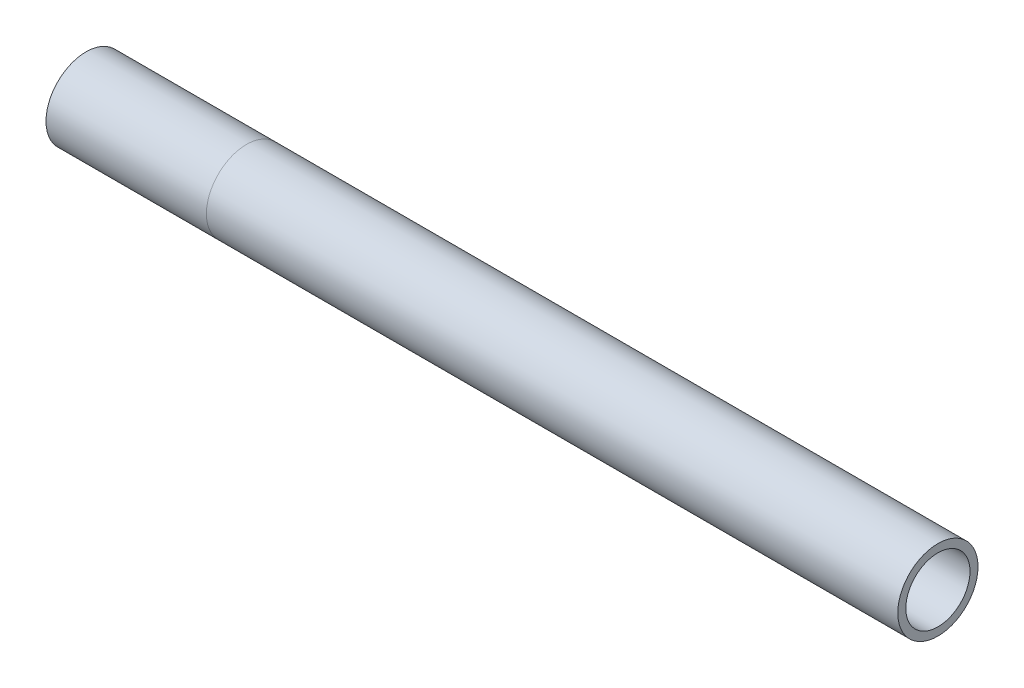
ISO-10303-21;
HEADER;
FILE_DESCRIPTION(('STEP AP214'),'2;1');
FILE_NAME('part.step','',(''),(''),'','','');
FILE_SCHEMA(('AUTOMOTIVE_DESIGN { 1 0 10303 214 1 1 1 1 }'));
ENDSEC;
DATA;
#1=APPLICATION_CONTEXT('core data for automotive mechanical design processes');
#2=APPLICATION_PROTOCOL_DEFINITION('international standard','automotive_design',2000,#1);
#3=PRODUCT_CONTEXT('',#1,'mechanical');
#4=PRODUCT('Part','Part','',(#3));
#5=PRODUCT_RELATED_PRODUCT_CATEGORY('part','',(#4));
#6=PRODUCT_DEFINITION_FORMATION('','',#4);
#7=PRODUCT_DEFINITION_CONTEXT('part definition',#1,'design');
#8=PRODUCT_DEFINITION('design','',#6,#7);
#9=PRODUCT_DEFINITION_SHAPE('','',#8);
#10=(LENGTH_UNIT() NAMED_UNIT(*) SI_UNIT(.MILLI.,.METRE.));
#11=(NAMED_UNIT(*) PLANE_ANGLE_UNIT() SI_UNIT($,.RADIAN.));
#12=(NAMED_UNIT(*) SI_UNIT($,.STERADIAN.) SOLID_ANGLE_UNIT());
#13=UNCERTAINTY_MEASURE_WITH_UNIT(LENGTH_MEASURE(1.E-05),#10,'distance_accuracy_value','');
#14=(GEOMETRIC_REPRESENTATION_CONTEXT(3) GLOBAL_UNCERTAINTY_ASSIGNED_CONTEXT((#13)) GLOBAL_UNIT_ASSIGNED_CONTEXT((#10,
#11,#12)) REPRESENTATION_CONTEXT('',''));
#15=CARTESIAN_POINT('',(0.,0.,0.));
#16=DIRECTION('',(0.,0.,1.));
#17=DIRECTION('',(1.,0.,0.));
#18=AXIS2_PLACEMENT_3D('',#15,#16,#17);
#19=CARTESIAN_POINT('',(-56.518138061836,25.8934908541217,0.));
#20=DIRECTION('',(-1.,0.,0.));
#21=DIRECTION('',(0.,0.,1.));
#22=AXIS2_PLACEMENT_3D('',#19,#20,#21);
#23=CYLINDRICAL_SURFACE('',#22,10.16);
#24=CARTESIAN_POINT('',(-107.318138061836,25.8934908541217,0.));
#25=DIRECTION('',(1.,0.,0.));
#26=DIRECTION('',(0.,0.,-1.));
#27=AXIS2_PLACEMENT_3D('',#24,#25,#26);
#28=CIRCLE('',#27,10.16);
#29=CARTESIAN_POINT('',(-107.318138061836,25.8934908541217,10.16));
#30=VERTEX_POINT('',#29);
#31=EDGE_CURVE('E58',#30,#30,#28,.T.);
#32=CARTESIAN_POINT('',(-56.518138061836,25.8934908541217,0.));
#33=DIRECTION('',(1.,0.,0.));
#34=DIRECTION('',(0.,0.,-1.));
#35=AXIS2_PLACEMENT_3D('',#32,#33,#34);
#36=CIRCLE('',#35,10.16);
#37=CARTESIAN_POINT('',(-56.518138061836,25.8934908541217,10.16));
#38=VERTEX_POINT('',#37);
#39=EDGE_CURVE('E54',#38,#38,#36,.T.);
#40=CARTESIAN_POINT('',(-107.318138061836,25.8934908541217,10.16));
#41=CARTESIAN_POINT('',(-106.788971395169,25.8934908541217,10.16));
#42=CARTESIAN_POINT('',(-106.259804728503,25.8934908541217,10.16));
#43=CARTESIAN_POINT('',(-105.201471395169,25.8934908541217,10.16));
#44=CARTESIAN_POINT('',(-104.672304728503,25.8934908541217,10.16));
#45=CARTESIAN_POINT('',(-103.613971395169,25.8934908541217,10.16));
#46=CARTESIAN_POINT('',(-103.084804728503,25.8934908541217,10.16));
#47=CARTESIAN_POINT('',(-102.026471395169,25.8934908541217,10.16));
#48=CARTESIAN_POINT('',(-101.497304728503,25.8934908541217,10.16));
#49=CARTESIAN_POINT('',(-100.438971395169,25.8934908541217,10.16));
#50=CARTESIAN_POINT('',(-99.9098047285027,25.8934908541217,10.16));
#51=CARTESIAN_POINT('',(-98.8514713951694,25.8934908541217,10.16));
#52=CARTESIAN_POINT('',(-98.3223047285027,25.8934908541217,10.16));
#53=CARTESIAN_POINT('',(-97.2639713951694,25.8934908541217,10.16));
#54=CARTESIAN_POINT('',(-96.7348047285027,25.8934908541217,10.16));
#55=CARTESIAN_POINT('',(-95.6764713951694,25.8934908541217,10.16));
#56=CARTESIAN_POINT('',(-95.1473047285027,25.8934908541217,10.16));
#57=CARTESIAN_POINT('',(-94.0889713951694,25.8934908541217,10.16));
#58=CARTESIAN_POINT('',(-93.5598047285027,25.8934908541217,10.16));
#59=CARTESIAN_POINT('',(-92.5014713951694,25.8934908541217,10.16));
#60=CARTESIAN_POINT('',(-91.9723047285027,25.8934908541217,10.16));
#61=CARTESIAN_POINT('',(-90.9139713951694,25.8934908541217,10.16));
#62=CARTESIAN_POINT('',(-90.3848047285027,25.8934908541217,10.16));
#63=CARTESIAN_POINT('',(-89.3264713951694,25.8934908541217,10.16));
#64=CARTESIAN_POINT('',(-88.7973047285027,25.8934908541217,10.16));
#65=CARTESIAN_POINT('',(-87.7389713951694,25.8934908541217,10.16));
#66=CARTESIAN_POINT('',(-87.2098047285027,25.8934908541217,10.16));
#67=CARTESIAN_POINT('',(-86.1514713951694,25.8934908541217,10.16));
#68=CARTESIAN_POINT('',(-85.6223047285027,25.8934908541217,10.16));
#69=CARTESIAN_POINT('',(-84.5639713951694,25.8934908541217,10.16));
#70=CARTESIAN_POINT('',(-84.0348047285027,25.8934908541217,10.16));
#71=CARTESIAN_POINT('',(-82.9764713951694,25.8934908541217,10.16));
#72=CARTESIAN_POINT('',(-82.4473047285027,25.8934908541217,10.16));
#73=CARTESIAN_POINT('',(-81.3889713951694,25.8934908541217,10.16));
#74=CARTESIAN_POINT('',(-80.8598047285027,25.8934908541217,10.16));
#75=CARTESIAN_POINT('',(-79.8014713951694,25.8934908541217,10.16));
#76=CARTESIAN_POINT('',(-79.2723047285027,25.8934908541217,10.16));
#77=CARTESIAN_POINT('',(-78.2139713951694,25.8934908541217,10.16));
#78=CARTESIAN_POINT('',(-77.6848047285027,25.8934908541217,10.16));
#79=CARTESIAN_POINT('',(-76.6264713951694,25.8934908541217,10.16));
#80=CARTESIAN_POINT('',(-76.0973047285027,25.8934908541217,10.16));
#81=CARTESIAN_POINT('',(-75.0389713951694,25.8934908541217,10.16));
#82=CARTESIAN_POINT('',(-74.5098047285027,25.8934908541217,10.16));
#83=CARTESIAN_POINT('',(-73.4514713951694,25.8934908541217,10.16));
#84=CARTESIAN_POINT('',(-72.9223047285027,25.8934908541217,10.16));
#85=CARTESIAN_POINT('',(-71.8639713951694,25.8934908541217,10.16));
#86=CARTESIAN_POINT('',(-71.3348047285027,25.8934908541217,10.16));
#87=CARTESIAN_POINT('',(-70.2764713951694,25.8934908541217,10.16));
#88=CARTESIAN_POINT('',(-69.7473047285027,25.8934908541217,10.16));
#89=CARTESIAN_POINT('',(-68.6889713951694,25.8934908541217,10.16));
#90=CARTESIAN_POINT('',(-68.1598047285027,25.8934908541217,10.16));
#91=CARTESIAN_POINT('',(-67.1014713951694,25.8934908541217,10.16));
#92=CARTESIAN_POINT('',(-66.5723047285027,25.8934908541217,10.16));
#93=CARTESIAN_POINT('',(-65.5139713951694,25.8934908541217,10.16));
#94=CARTESIAN_POINT('',(-64.9848047285027,25.8934908541217,10.16));
#95=CARTESIAN_POINT('',(-63.9264713951694,25.8934908541217,10.16));
#96=CARTESIAN_POINT('',(-63.3973047285027,25.8934908541217,10.16));
#97=CARTESIAN_POINT('',(-62.3389713951694,25.8934908541217,10.16));
#98=CARTESIAN_POINT('',(-61.8098047285027,25.8934908541217,10.16));
#99=CARTESIAN_POINT('',(-60.7514713951694,25.8934908541217,10.16));
#100=CARTESIAN_POINT('',(-60.2223047285027,25.8934908541217,10.16));
#101=CARTESIAN_POINT('',(-59.1639713951694,25.8934908541217,10.16));
#102=CARTESIAN_POINT('',(-58.6348047285027,25.8934908541217,10.16));
#103=CARTESIAN_POINT('',(-57.5764713951694,25.8934908541217,10.16));
#104=CARTESIAN_POINT('',(-57.0473047285027,25.8934908541217,10.16));
#105=CARTESIAN_POINT('',(-56.518138061836,25.8934908541217,10.16));
#106=B_SPLINE_CURVE_WITH_KNOTS('',3,(#40,#41,#42,#43,#44,#45,#46,#47,#48,#49,#50,#51,#52,#53,
#54,#55,#56,#57,#58,#59,#60,#61,#62,#63,#64,#65,#66,#67,#68,#69,#70,#71,#72,#73,#74,#75,#76,#77,
#78,#79,#80,#81,#82,#83,#84,#85,#86,#87,#88,#89,#90,#91,#92,#93,#94,#95,#96,#97,#98,#99,#100,
#101,#102,#103,#104,#105),.UNSPECIFIED.,.F.,.F.,(4,2,2,2,2,2,2,2,2,2,2,2,2,2,2,2,2,2,2,2,2,2,2,
2,2,2,2,2,2,2,2,2,4),(0.,1.58750000000001,3.175,4.7625,6.35000000000001,7.9375,9.52500000000001,
11.1125,12.7,14.2875,15.875,17.4625,19.05,20.6375,22.225,23.8125,25.4,26.9875,28.575,30.1625,
31.75,33.3375,34.925,36.5125,38.1,39.6875,41.275,42.8625,44.45,46.0375,47.625,49.2125,50.8),.UNSPECIFIED.);
#107=EDGE_CURVE('BSEAM50',#30,#38,#106,.T.);
#108=ORIENTED_EDGE('',*,*,#31,.F.);
#109=ORIENTED_EDGE('',*,*,#39,.T.);
#110=ORIENTED_EDGE('',*,*,#107,.T.);
#111=ORIENTED_EDGE('',*,*,#107,.F.);
#112=EDGE_LOOP('',(#108,#110,#109,#111));
#113=FACE_BOUND('',#112,.T.);
#114=ADVANCED_FACE('F50',(#113),#23,.F.);
#115=CARTESIAN_POINT('',(-56.518138061836,25.8934908541217,0.));
#116=DIRECTION('',(-1.,0.,0.));
#117=DIRECTION('',(0.,0.,1.));
#118=AXIS2_PLACEMENT_3D('',#115,#116,#117);
#119=CYLINDRICAL_SURFACE('',#118,12.7);
#120=CARTESIAN_POINT('',(-107.318138061836,25.8934908541217,0.));
#121=DIRECTION('',(1.,0.,0.));
#122=DIRECTION('',(0.,0.,-1.));
#123=AXIS2_PLACEMENT_3D('',#120,#121,#122);
#124=CIRCLE('',#123,12.7);
#125=CARTESIAN_POINT('',(-107.318138061836,25.8934908541217,12.7));
#126=VERTEX_POINT('',#125);
#127=EDGE_CURVE('E62',#126,#126,#124,.T.);
#128=CARTESIAN_POINT('',(-56.518138061836,25.8934908541217,0.));
#129=DIRECTION('',(1.,0.,0.));
#130=DIRECTION('',(0.,0.,-1.));
#131=AXIS2_PLACEMENT_3D('',#128,#129,#130);
#132=CIRCLE('',#131,12.7);
#133=CARTESIAN_POINT('',(-56.518138061836,25.8934908541217,12.7));
#134=VERTEX_POINT('',#133);
#135=EDGE_CURVE('E12',#134,#134,#132,.T.);
#136=CARTESIAN_POINT('',(-107.318138061836,25.8934908541217,12.7));
#137=CARTESIAN_POINT('',(-106.788971395169,25.8934908541217,12.7));
#138=CARTESIAN_POINT('',(-106.259804728503,25.8934908541217,12.7));
#139=CARTESIAN_POINT('',(-105.201471395169,25.8934908541217,12.7));
#140=CARTESIAN_POINT('',(-104.672304728503,25.8934908541217,12.7));
#141=CARTESIAN_POINT('',(-103.613971395169,25.8934908541217,12.7));
#142=CARTESIAN_POINT('',(-103.084804728503,25.8934908541217,12.7));
#143=CARTESIAN_POINT('',(-102.026471395169,25.8934908541217,12.7));
#144=CARTESIAN_POINT('',(-101.497304728503,25.8934908541217,12.7));
#145=CARTESIAN_POINT('',(-100.438971395169,25.8934908541217,12.7));
#146=CARTESIAN_POINT('',(-99.9098047285027,25.8934908541217,12.7));
#147=CARTESIAN_POINT('',(-98.8514713951694,25.8934908541217,12.7));
#148=CARTESIAN_POINT('',(-98.3223047285027,25.8934908541217,12.7));
#149=CARTESIAN_POINT('',(-97.2639713951694,25.8934908541217,12.7));
#150=CARTESIAN_POINT('',(-96.7348047285027,25.8934908541217,12.7));
#151=CARTESIAN_POINT('',(-95.6764713951694,25.8934908541217,12.7));
#152=CARTESIAN_POINT('',(-95.1473047285027,25.8934908541217,12.7));
#153=CARTESIAN_POINT('',(-94.0889713951694,25.8934908541217,12.7));
#154=CARTESIAN_POINT('',(-93.5598047285027,25.8934908541217,12.7));
#155=CARTESIAN_POINT('',(-92.5014713951694,25.8934908541217,12.7));
#156=CARTESIAN_POINT('',(-91.9723047285027,25.8934908541217,12.7));
#157=CARTESIAN_POINT('',(-90.9139713951694,25.8934908541217,12.7));
#158=CARTESIAN_POINT('',(-90.3848047285027,25.8934908541217,12.7));
#159=CARTESIAN_POINT('',(-89.3264713951694,25.8934908541217,12.7));
#160=CARTESIAN_POINT('',(-88.7973047285027,25.8934908541217,12.7));
#161=CARTESIAN_POINT('',(-87.7389713951694,25.8934908541217,12.7));
#162=CARTESIAN_POINT('',(-87.2098047285027,25.8934908541217,12.7));
#163=CARTESIAN_POINT('',(-86.1514713951694,25.8934908541217,12.7));
#164=CARTESIAN_POINT('',(-85.6223047285027,25.8934908541217,12.7));
#165=CARTESIAN_POINT('',(-84.5639713951694,25.8934908541217,12.7));
#166=CARTESIAN_POINT('',(-84.0348047285027,25.8934908541217,12.7));
#167=CARTESIAN_POINT('',(-82.9764713951694,25.8934908541217,12.7));
#168=CARTESIAN_POINT('',(-82.4473047285027,25.8934908541217,12.7));
#169=CARTESIAN_POINT('',(-81.3889713951694,25.8934908541217,12.7));
#170=CARTESIAN_POINT('',(-80.8598047285027,25.8934908541217,12.7));
#171=CARTESIAN_POINT('',(-79.8014713951694,25.8934908541217,12.7));
#172=CARTESIAN_POINT('',(-79.2723047285027,25.8934908541217,12.7));
#173=CARTESIAN_POINT('',(-78.2139713951694,25.8934908541217,12.7));
#174=CARTESIAN_POINT('',(-77.6848047285027,25.8934908541217,12.7));
#175=CARTESIAN_POINT('',(-76.6264713951694,25.8934908541217,12.7));
#176=CARTESIAN_POINT('',(-76.0973047285027,25.8934908541217,12.7));
#177=CARTESIAN_POINT('',(-75.0389713951694,25.8934908541217,12.7));
#178=CARTESIAN_POINT('',(-74.5098047285027,25.8934908541217,12.7));
#179=CARTESIAN_POINT('',(-73.4514713951694,25.8934908541217,12.7));
#180=CARTESIAN_POINT('',(-72.9223047285027,25.8934908541217,12.7));
#181=CARTESIAN_POINT('',(-71.8639713951694,25.8934908541217,12.7));
#182=CARTESIAN_POINT('',(-71.3348047285027,25.8934908541217,12.7));
#183=CARTESIAN_POINT('',(-70.2764713951694,25.8934908541217,12.7));
#184=CARTESIAN_POINT('',(-69.7473047285027,25.8934908541217,12.7));
#185=CARTESIAN_POINT('',(-68.6889713951694,25.8934908541217,12.7));
#186=CARTESIAN_POINT('',(-68.1598047285027,25.8934908541217,12.7));
#187=CARTESIAN_POINT('',(-67.1014713951694,25.8934908541217,12.7));
#188=CARTESIAN_POINT('',(-66.5723047285027,25.8934908541217,12.7));
#189=CARTESIAN_POINT('',(-65.5139713951694,25.8934908541217,12.7));
#190=CARTESIAN_POINT('',(-64.9848047285027,25.8934908541217,12.7));
#191=CARTESIAN_POINT('',(-63.9264713951694,25.8934908541217,12.7));
#192=CARTESIAN_POINT('',(-63.3973047285027,25.8934908541217,12.7));
#193=CARTESIAN_POINT('',(-62.3389713951694,25.8934908541217,12.7));
#194=CARTESIAN_POINT('',(-61.8098047285027,25.8934908541217,12.7));
#195=CARTESIAN_POINT('',(-60.7514713951694,25.8934908541217,12.7));
#196=CARTESIAN_POINT('',(-60.2223047285027,25.8934908541217,12.7));
#197=CARTESIAN_POINT('',(-59.1639713951694,25.8934908541217,12.7));
#198=CARTESIAN_POINT('',(-58.6348047285027,25.8934908541217,12.7));
#199=CARTESIAN_POINT('',(-57.5764713951694,25.8934908541217,12.7));
#200=CARTESIAN_POINT('',(-57.0473047285027,25.8934908541217,12.7));
#201=CARTESIAN_POINT('',(-56.518138061836,25.8934908541217,12.7));
#202=B_SPLINE_CURVE_WITH_KNOTS('',3,(#136,#137,#138,#139,#140,#141,#142,#143,#144,#145,#146,
#147,#148,#149,#150,#151,#152,#153,#154,#155,#156,#157,#158,#159,#160,#161,#162,#163,#164,#165,
#166,#167,#168,#169,#170,#171,#172,#173,#174,#175,#176,#177,#178,#179,#180,#181,#182,#183,#184,
#185,#186,#187,#188,#189,#190,#191,#192,#193,#194,#195,#196,#197,#198,#199,#200,#201),
.UNSPECIFIED.,.F.,.F.,(4,2,2,2,2,2,2,2,2,2,2,2,2,2,2,2,2,2,2,2,2,2,2,2,2,2,2,2,2,2,2,2,4),(0.,
1.58750000000001,3.175,4.7625,6.35000000000001,7.9375,9.52500000000001,11.1125,12.7,14.2875,
15.875,17.4625,19.05,20.6375,22.225,23.8125,25.4,26.9875,28.575,30.1625,31.75,33.3375,34.925,
36.5125,38.1,39.6875,41.275,42.8625,44.45,46.0375,47.625,49.2125,50.8),.UNSPECIFIED.);
#203=EDGE_CURVE('BSEAM77',#126,#134,#202,.T.);
#204=ORIENTED_EDGE('',*,*,#127,.T.);
#205=ORIENTED_EDGE('',*,*,#135,.F.);
#206=ORIENTED_EDGE('',*,*,#203,.T.);
#207=ORIENTED_EDGE('',*,*,#203,.F.);
#208=EDGE_LOOP('',(#204,#206,#205,#207));
#209=FACE_BOUND('',#208,.T.);
#210=ADVANCED_FACE('F77',(#209),#119,.T.);
#211=CARTESIAN_POINT('',(-107.318138061836,25.8934908541217,0.));
#212=DIRECTION('',(1.,0.,0.));
#213=DIRECTION('',(0.,0.,-1.));
#214=AXIS2_PLACEMENT_3D('',#211,#212,#213);
#215=PLANE('',#214);
#216=ORIENTED_EDGE('',*,*,#31,.T.);
#217=EDGE_LOOP('',(#216));
#218=FACE_BOUND('',#217,.T.);
#219=ORIENTED_EDGE('',*,*,#127,.F.);
#220=EDGE_LOOP('',(#219));
#221=FACE_BOUND('',#220,.T.);
#222=ADVANCED_FACE('F73',(#218,#221),#215,.F.);
#223=CARTESIAN_POINT('',(-56.518138061836,25.8934908541217,0.));
#224=DIRECTION('',(1.,0.,0.));
#225=DIRECTION('',(0.,0.,-1.));
#226=AXIS2_PLACEMENT_3D('',#223,#224,#225);
#227=PLANE('',#226);
#228=ORIENTED_EDGE('',*,*,#39,.F.);
#229=EDGE_LOOP('',(#228));
#230=FACE_BOUND('',#229,.T.);
#231=ORIENTED_EDGE('',*,*,#135,.T.);
#232=EDGE_LOOP('',(#231));
#233=FACE_BOUND('',#232,.T.);
#234=ADVANCED_FACE('F52',(#230,#233),#227,.T.);
#235=CLOSED_SHELL('',(#114,#210,#222,#234));
#236=MANIFOLD_SOLID_BREP('B2',#235);
#237=CARTESIAN_POINT('',(162.429861938164,25.8934908541217,0.));
#238=DIRECTION('',(-1.,0.,0.));
#239=DIRECTION('',(0.,-1.,0.));
#240=AXIS2_PLACEMENT_3D('',#237,#238,#239);
#241=CYLINDRICAL_SURFACE('',#240,10.16);
#242=CARTESIAN_POINT('',(162.429861938164,25.8934908541217,0.));
#243=DIRECTION('',(1.,0.,0.));
#244=DIRECTION('',(0.,0.,-1.));
#245=AXIS2_PLACEMENT_3D('',#242,#243,#244);
#246=CIRCLE('',#245,10.16);
#247=CARTESIAN_POINT('',(162.429861938164,25.8934908541217,-10.16));
#248=VERTEX_POINT('',#247);
#249=EDGE_CURVE('E148',#248,#248,#246,.T.);
#250=ORIENTED_EDGE('',*,*,#249,.T.);
#251=EDGE_LOOP('',(#250));
#252=FACE_BOUND('',#251,.T.);
#253=CARTESIAN_POINT('',(-56.518138061836,25.8934908541217,0.));
#254=DIRECTION('',(-1.,0.,0.));
#255=DIRECTION('',(0.,0.,1.));
#256=AXIS2_PLACEMENT_3D('',#253,#254,#255);
#257=CIRCLE('',#256,10.16);
#258=CARTESIAN_POINT('',(-56.518138061836,25.8934908541217,10.16));
#259=VERTEX_POINT('',#258);
#260=EDGE_CURVE('E138',#259,#259,#257,.T.);
#261=ORIENTED_EDGE('',*,*,#260,.T.);
#262=EDGE_LOOP('',(#261));
#263=FACE_BOUND('',#262,.T.);
#264=ADVANCED_FACE('F134',(#252,#263),#241,.F.);
#265=CARTESIAN_POINT('',(162.429861938164,25.8934908541217,0.));
#266=DIRECTION('',(-1.,0.,0.));
#267=DIRECTION('',(0.,-1.,0.));
#268=AXIS2_PLACEMENT_3D('',#265,#266,#267);
#269=CYLINDRICAL_SURFACE('',#268,12.7);
#270=CARTESIAN_POINT('',(162.429861938164,25.8934908541217,0.));
#271=DIRECTION('',(1.,0.,0.));
#272=DIRECTION('',(0.,0.,-1.));
#273=AXIS2_PLACEMENT_3D('',#270,#271,#272);
#274=CIRCLE('',#273,12.7);
#275=CARTESIAN_POINT('',(162.429861938164,25.8934908541217,-12.7));
#276=VERTEX_POINT('',#275);
#277=EDGE_CURVE('E142',#276,#276,#274,.T.);
#278=ORIENTED_EDGE('',*,*,#277,.F.);
#279=EDGE_LOOP('',(#278));
#280=FACE_BOUND('',#279,.T.);
#281=CARTESIAN_POINT('',(-56.518138061836,25.8934908541217,0.));
#282=DIRECTION('',(-1.,0.,0.));
#283=DIRECTION('',(0.,0.,1.));
#284=AXIS2_PLACEMENT_3D('',#281,#282,#283);
#285=CIRCLE('',#284,12.7);
#286=CARTESIAN_POINT('',(-56.518138061836,25.8934908541217,12.7));
#287=VERTEX_POINT('',#286);
#288=EDGE_CURVE('E49',#287,#287,#285,.T.);
#289=ORIENTED_EDGE('',*,*,#288,.F.);
#290=EDGE_LOOP('',(#289));
#291=FACE_BOUND('',#290,.T.);
#292=ADVANCED_FACE('F161',(#280,#291),#269,.T.);
#293=CARTESIAN_POINT('',(162.429861938164,25.8934908541217,0.));
#294=DIRECTION('',(1.,0.,0.));
#295=DIRECTION('',(0.,0.,-1.));
#296=AXIS2_PLACEMENT_3D('',#293,#294,#295);
#297=PLANE('',#296);
#298=ORIENTED_EDGE('',*,*,#249,.F.);
#299=EDGE_LOOP('',(#298));
#300=FACE_BOUND('',#299,.T.);
#301=ORIENTED_EDGE('',*,*,#277,.T.);
#302=EDGE_LOOP('',(#301));
#303=FACE_BOUND('',#302,.T.);
#304=ADVANCED_FACE('F157',(#300,#303),#297,.T.);
#305=CARTESIAN_POINT('',(-56.518138061836,25.8934908541217,0.));
#306=DIRECTION('',(-1.,0.,0.));
#307=DIRECTION('',(0.,0.,1.));
#308=AXIS2_PLACEMENT_3D('',#305,#306,#307);
#309=PLANE('',#308);
#310=ORIENTED_EDGE('',*,*,#260,.F.);
#311=EDGE_LOOP('',(#310));
#312=FACE_BOUND('',#311,.T.);
#313=ORIENTED_EDGE('',*,*,#288,.T.);
#314=EDGE_LOOP('',(#313));
#315=FACE_BOUND('',#314,.T.);
#316=ADVANCED_FACE('F136',(#312,#315),#309,.T.);
#317=CLOSED_SHELL('',(#264,#292,#304,#316));
#318=MANIFOLD_SOLID_BREP('B7',#317);
#319=ADVANCED_BREP_SHAPE_REPRESENTATION('',(#18,#236,#318),#14);
#320=SHAPE_DEFINITION_REPRESENTATION(#9,#319);
ENDSEC;
END-ISO-10303-21;
